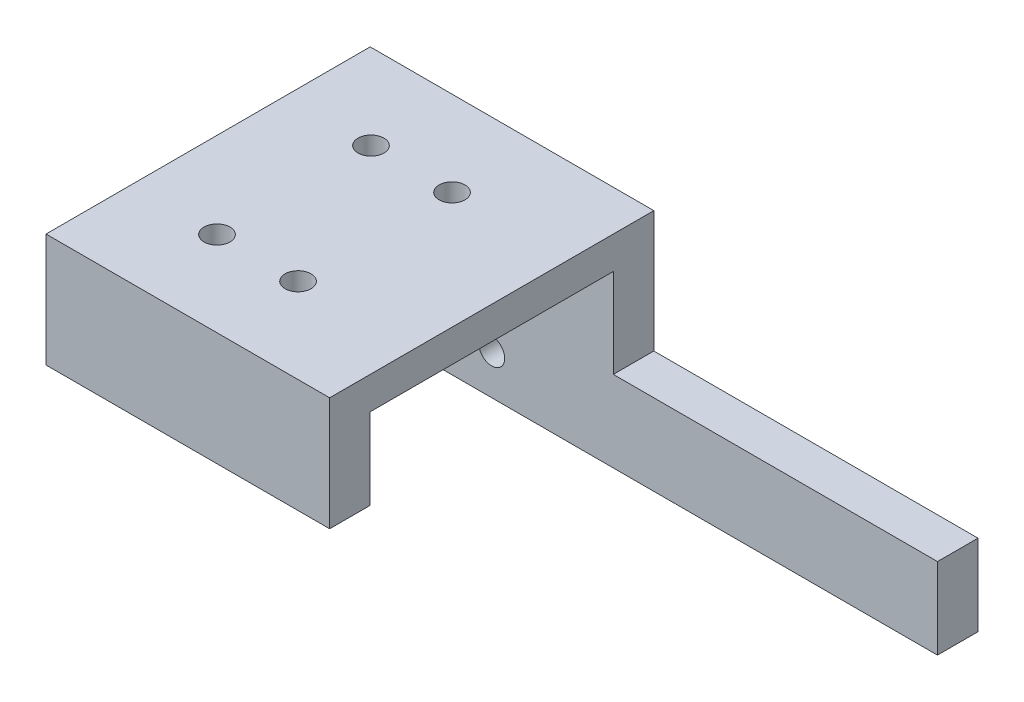
ISO-10303-21;
HEADER;
FILE_DESCRIPTION(('STEP AP214'),'2;1');
FILE_NAME('part.step','',(''),(''),'','','');
FILE_SCHEMA(('AUTOMOTIVE_DESIGN { 1 0 10303 214 1 1 1 1 }'));
ENDSEC;
DATA;
#1=APPLICATION_CONTEXT('core data for automotive mechanical design processes');
#2=APPLICATION_PROTOCOL_DEFINITION('international standard','automotive_design',2000,#1);
#3=PRODUCT_CONTEXT('',#1,'mechanical');
#4=PRODUCT('Part','Part','',(#3));
#5=PRODUCT_RELATED_PRODUCT_CATEGORY('part','',(#4));
#6=PRODUCT_DEFINITION_FORMATION('','',#4);
#7=PRODUCT_DEFINITION_CONTEXT('part definition',#1,'design');
#8=PRODUCT_DEFINITION('design','',#6,#7);
#9=PRODUCT_DEFINITION_SHAPE('','',#8);
#10=(LENGTH_UNIT() NAMED_UNIT(*) SI_UNIT(.MILLI.,.METRE.));
#11=(NAMED_UNIT(*) PLANE_ANGLE_UNIT() SI_UNIT($,.RADIAN.));
#12=(NAMED_UNIT(*) SI_UNIT($,.STERADIAN.) SOLID_ANGLE_UNIT());
#13=UNCERTAINTY_MEASURE_WITH_UNIT(LENGTH_MEASURE(1.E-05),#10,'distance_accuracy_value','');
#14=(GEOMETRIC_REPRESENTATION_CONTEXT(3) GLOBAL_UNCERTAINTY_ASSIGNED_CONTEXT((#13)) GLOBAL_UNIT_ASSIGNED_CONTEXT((#10,
#11,#12)) REPRESENTATION_CONTEXT('',''));
#15=CARTESIAN_POINT('',(0.,0.,0.));
#16=DIRECTION('',(0.,0.,1.));
#17=DIRECTION('',(1.,0.,0.));
#18=AXIS2_PLACEMENT_3D('',#15,#16,#17);
#19=CARTESIAN_POINT('',(0.,0.,0.));
#20=DIRECTION('',(0.,-1.,0.));
#21=DIRECTION('',(0.,0.,-1.));
#22=AXIS2_PLACEMENT_3D('',#19,#20,#21);
#23=PLANE('',#22);
#24=CARTESIAN_POINT('',(10.6,0.,-10.5));
#25=DIRECTION('',(0.,-1.,0.));
#26=DIRECTION('',(0.,0.,-1.));
#27=AXIS2_PLACEMENT_3D('',#24,#25,#26);
#28=CIRCLE('',#27,1.6);
#29=CARTESIAN_POINT('',(10.6,0.,-12.1));
#30=VERTEX_POINT('',#29);
#31=EDGE_CURVE('E214',#30,#30,#28,.T.);
#32=ORIENTED_EDGE('',*,*,#31,.F.);
#33=EDGE_LOOP('',(#32));
#34=FACE_BOUND('',#33,.T.);
#35=CARTESIAN_POINT('',(20.6,0.,-10.5));
#36=DIRECTION('',(0.,-1.,0.));
#37=DIRECTION('',(0.,0.,-1.));
#38=AXIS2_PLACEMENT_3D('',#35,#36,#37);
#39=CIRCLE('',#38,1.6);
#40=CARTESIAN_POINT('',(20.6,0.,-12.1));
#41=VERTEX_POINT('',#40);
#42=EDGE_CURVE('E226',#41,#41,#39,.T.);
#43=ORIENTED_EDGE('',*,*,#42,.F.);
#44=EDGE_LOOP('',(#43));
#45=FACE_BOUND('',#44,.T.);
#46=CARTESIAN_POINT('',(20.6,0.,-29.5));
#47=DIRECTION('',(0.,-1.,0.));
#48=DIRECTION('',(0.,0.,-1.));
#49=AXIS2_PLACEMENT_3D('',#46,#47,#48);
#50=CIRCLE('',#49,1.6);
#51=CARTESIAN_POINT('',(20.6,0.,-31.1));
#52=VERTEX_POINT('',#51);
#53=EDGE_CURVE('E223',#52,#52,#50,.T.);
#54=ORIENTED_EDGE('',*,*,#53,.F.);
#55=EDGE_LOOP('',(#54));
#56=FACE_BOUND('',#55,.T.);
#57=CARTESIAN_POINT('',(10.6,0.,-29.5));
#58=DIRECTION('',(0.,-1.,0.));
#59=DIRECTION('',(0.,0.,-1.));
#60=AXIS2_PLACEMENT_3D('',#57,#58,#59);
#61=CIRCLE('',#60,1.6);
#62=CARTESIAN_POINT('',(10.6,0.,-31.1));
#63=VERTEX_POINT('',#62);
#64=EDGE_CURVE('E202',#63,#63,#61,.T.);
#65=ORIENTED_EDGE('',*,*,#64,.F.);
#66=EDGE_LOOP('',(#65));
#67=FACE_BOUND('',#66,.T.);
#68=DIRECTION('',(0.,0.,-1.));
#69=VECTOR('',#68,1.);
#70=CARTESIAN_POINT('',(35.,0.,0.));
#71=LINE('',#70,#69);
#72=CARTESIAN_POINT('',(35.,0.,-5.));
#73=VERTEX_POINT('',#72);
#74=CARTESIAN_POINT('',(35.,0.,-35.));
#75=VERTEX_POINT('',#74);
#76=EDGE_CURVE('E62',#73,#75,#71,.T.);
#77=ORIENTED_EDGE('',*,*,#76,.F.);
#78=DIRECTION('',(1.,0.,0.));
#79=VECTOR('',#78,1.);
#80=CARTESIAN_POINT('',(0.,0.,-5.));
#81=LINE('',#80,#79);
#82=CARTESIAN_POINT('',(0.,0.,-5.));
#83=VERTEX_POINT('',#82);
#84=EDGE_CURVE('E136',#83,#73,#81,.T.);
#85=ORIENTED_EDGE('',*,*,#84,.F.);
#86=DIRECTION('',(0.,0.,1.));
#87=VECTOR('',#86,1.);
#88=CARTESIAN_POINT('',(0.,0.,0.));
#89=LINE('',#88,#87);
#90=CARTESIAN_POINT('',(0.,0.,-35.));
#91=VERTEX_POINT('',#90);
#92=EDGE_CURVE('E140',#91,#83,#89,.T.);
#93=ORIENTED_EDGE('',*,*,#92,.F.);
#94=DIRECTION('',(-1.,0.,0.));
#95=VECTOR('',#94,1.);
#96=CARTESIAN_POINT('',(0.,0.,-35.));
#97=LINE('',#96,#95);
#98=EDGE_CURVE('E179',#75,#91,#97,.T.);
#99=ORIENTED_EDGE('',*,*,#98,.F.);
#100=EDGE_LOOP('',(#77,#85,#93,#99));
#101=FACE_BOUND('',#100,.T.);
#102=ADVANCED_FACE('F37',(#34,#45,#56,#67,#101),#23,.T.);
#103=CARTESIAN_POINT('',(20.,-16.,-25.));
#104=DIRECTION('',(0.,0.,-1.));
#105=DIRECTION('',(-1.,0.,0.));
#106=AXIS2_PLACEMENT_3D('',#103,#104,#105);
#107=CYLINDRICAL_SURFACE('',#106,1.6);
#108=CARTESIAN_POINT('',(20.,-16.,-35.));
#109=DIRECTION('',(0.,0.,-1.));
#110=DIRECTION('',(-1.,0.,0.));
#111=AXIS2_PLACEMENT_3D('',#108,#109,#110);
#112=CIRCLE('',#111,1.6);
#113=CARTESIAN_POINT('',(18.4,-16.,-35.));
#114=VERTEX_POINT('',#113);
#115=EDGE_CURVE('E231',#114,#114,#112,.T.);
#116=ORIENTED_EDGE('',*,*,#115,.F.);
#117=EDGE_LOOP('',(#116));
#118=FACE_BOUND('',#117,.T.);
#119=CARTESIAN_POINT('',(20.,-16.,-38.));
#120=DIRECTION('',(0.,0.,-1.));
#121=DIRECTION('',(-1.,0.,0.));
#122=AXIS2_PLACEMENT_3D('',#119,#120,#121);
#123=CIRCLE('',#122,1.6);
#124=CARTESIAN_POINT('',(18.4,-16.,-38.));
#125=VERTEX_POINT('',#124);
#126=EDGE_CURVE('E41',#125,#125,#123,.F.);
#127=ORIENTED_EDGE('',*,*,#126,.F.);
#128=EDGE_LOOP('',(#127));
#129=FACE_BOUND('',#128,.T.);
#130=ADVANCED_FACE('F243',(#118,#129),#107,.F.);
#131=CARTESIAN_POINT('',(10.,-16.,-25.));
#132=DIRECTION('',(0.,0.,-1.));
#133=DIRECTION('',(-1.,0.,0.));
#134=AXIS2_PLACEMENT_3D('',#131,#132,#133);
#135=CYLINDRICAL_SURFACE('',#134,1.6);
#136=CARTESIAN_POINT('',(10.,-16.,-35.));
#137=DIRECTION('',(0.,0.,-1.));
#138=DIRECTION('',(-1.,0.,0.));
#139=AXIS2_PLACEMENT_3D('',#136,#137,#138);
#140=CIRCLE('',#139,1.6);
#141=CARTESIAN_POINT('',(8.4,-16.,-35.));
#142=VERTEX_POINT('',#141);
#143=EDGE_CURVE('E186',#142,#142,#140,.T.);
#144=ORIENTED_EDGE('',*,*,#143,.F.);
#145=EDGE_LOOP('',(#144));
#146=FACE_BOUND('',#145,.T.);
#147=CARTESIAN_POINT('',(10.,-16.,-38.));
#148=DIRECTION('',(0.,0.,-1.));
#149=DIRECTION('',(-1.,0.,0.));
#150=AXIS2_PLACEMENT_3D('',#147,#148,#149);
#151=CIRCLE('',#150,1.6);
#152=CARTESIAN_POINT('',(8.4,-16.,-38.));
#153=VERTEX_POINT('',#152);
#154=EDGE_CURVE('E166',#153,#153,#151,.F.);
#155=ORIENTED_EDGE('',*,*,#154,.F.);
#156=EDGE_LOOP('',(#155));
#157=FACE_BOUND('',#156,.T.);
#158=ADVANCED_FACE('F245',(#146,#157),#135,.F.);
#159=CARTESIAN_POINT('',(0.,4.,0.));
#160=DIRECTION('',(1.,0.,0.));
#161=DIRECTION('',(0.,0.,-1.));
#162=AXIS2_PLACEMENT_3D('',#159,#160,#161);
#163=PLANE('',#162);
#164=DIRECTION('',(0.,-1.,0.));
#165=VECTOR('',#164,1.);
#166=CARTESIAN_POINT('',(0.,4.,-40.));
#167=LINE('',#166,#165);
#168=CARTESIAN_POINT('',(0.,4.,-40.));
#169=VERTEX_POINT('',#168);
#170=CARTESIAN_POINT('',(0.,-21.,-40.));
#171=VERTEX_POINT('',#170);
#172=EDGE_CURVE('E212',#169,#171,#167,.T.);
#173=ORIENTED_EDGE('',*,*,#172,.T.);
#174=DIRECTION('',(0.,0.,-1.));
#175=VECTOR('',#174,1.);
#176=CARTESIAN_POINT('',(0.,-21.,-40.));
#177=LINE('',#176,#175);
#178=CARTESIAN_POINT('',(0.,-21.,-35.));
#179=VERTEX_POINT('',#178);
#180=EDGE_CURVE('E175',#179,#171,#177,.T.);
#181=ORIENTED_EDGE('',*,*,#180,.F.);
#182=DIRECTION('',(0.,1.,0.));
#183=VECTOR('',#182,1.);
#184=CARTESIAN_POINT('',(0.,-21.,-35.));
#185=LINE('',#184,#183);
#186=EDGE_CURVE('E183',#179,#91,#185,.T.);
#187=ORIENTED_EDGE('',*,*,#186,.T.);
#188=ORIENTED_EDGE('',*,*,#92,.T.);
#189=DIRECTION('',(0.,1.,0.));
#190=VECTOR('',#189,1.);
#191=CARTESIAN_POINT('',(0.,-10.,-5.));
#192=LINE('',#191,#190);
#193=CARTESIAN_POINT('',(0.,-10.,-5.));
#194=VERTEX_POINT('',#193);
#195=EDGE_CURVE('E120',#194,#83,#192,.T.);
#196=ORIENTED_EDGE('',*,*,#195,.F.);
#197=DIRECTION('',(0.,0.,-1.));
#198=VECTOR('',#197,1.);
#199=CARTESIAN_POINT('',(0.,-10.,0.));
#200=LINE('',#199,#198);
#201=CARTESIAN_POINT('',(0.,-10.,0.));
#202=VERTEX_POINT('',#201);
#203=EDGE_CURVE('E127',#202,#194,#200,.T.);
#204=ORIENTED_EDGE('',*,*,#203,.F.);
#205=DIRECTION('',(0.,-1.,0.));
#206=VECTOR('',#205,1.);
#207=CARTESIAN_POINT('',(0.,4.,0.));
#208=LINE('',#207,#206);
#209=CARTESIAN_POINT('',(0.,4.,0.));
#210=VERTEX_POINT('',#209);
#211=EDGE_CURVE('E11',#210,#202,#208,.T.);
#212=ORIENTED_EDGE('',*,*,#211,.F.);
#213=DIRECTION('',(0.,0.,1.));
#214=VECTOR('',#213,1.);
#215=CARTESIAN_POINT('',(0.,4.,0.));
#216=LINE('',#215,#214);
#217=EDGE_CURVE('E203',#169,#210,#216,.T.);
#218=ORIENTED_EDGE('',*,*,#217,.F.);
#219=EDGE_LOOP('',(#173,#181,#187,#188,#196,#204,#212,#218));
#220=FACE_BOUND('',#219,.T.);
#221=ADVANCED_FACE('F39',(#220),#163,.F.);
#222=CARTESIAN_POINT('',(0.,4.,0.));
#223=DIRECTION('',(0.,0.,-1.));
#224=DIRECTION('',(-1.,0.,0.));
#225=AXIS2_PLACEMENT_3D('',#222,#223,#224);
#226=PLANE('',#225);
#227=ORIENTED_EDGE('',*,*,#211,.T.);
#228=DIRECTION('',(-1.,0.,0.));
#229=VECTOR('',#228,1.);
#230=CARTESIAN_POINT('',(0.,-10.,0.));
#231=LINE('',#230,#229);
#232=CARTESIAN_POINT('',(35.,-10.,0.));
#233=VERTEX_POINT('',#232);
#234=EDGE_CURVE('E133',#233,#202,#231,.T.);
#235=ORIENTED_EDGE('',*,*,#234,.F.);
#236=DIRECTION('',(0.,-1.,0.));
#237=VECTOR('',#236,1.);
#238=CARTESIAN_POINT('',(35.,4.,0.));
#239=LINE('',#238,#237);
#240=CARTESIAN_POINT('',(35.,4.,0.));
#241=VERTEX_POINT('',#240);
#242=EDGE_CURVE('E46',#241,#233,#239,.T.);
#243=ORIENTED_EDGE('',*,*,#242,.F.);
#244=DIRECTION('',(1.,0.,0.));
#245=VECTOR('',#244,1.);
#246=CARTESIAN_POINT('',(0.,4.,0.));
#247=LINE('',#246,#245);
#248=EDGE_CURVE('E206',#210,#241,#247,.T.);
#249=ORIENTED_EDGE('',*,*,#248,.F.);
#250=EDGE_LOOP('',(#227,#235,#243,#249));
#251=FACE_BOUND('',#250,.T.);
#252=ADVANCED_FACE('F294',(#251),#226,.F.);
#253=CARTESIAN_POINT('',(35.,4.,0.));
#254=DIRECTION('',(-1.,0.,0.));
#255=DIRECTION('',(0.,0.,1.));
#256=AXIS2_PLACEMENT_3D('',#253,#254,#255);
#257=PLANE('',#256);
#258=DIRECTION('',(0.,1.,0.));
#259=VECTOR('',#258,1.);
#260=CARTESIAN_POINT('',(35.,-21.,-35.));
#261=LINE('',#260,#259);
#262=CARTESIAN_POINT('',(35.,-11.,-35.));
#263=VERTEX_POINT('',#262);
#264=EDGE_CURVE('E188',#263,#75,#261,.T.);
#265=ORIENTED_EDGE('',*,*,#264,.F.);
#266=DIRECTION('',(0.,0.,-1.));
#267=VECTOR('',#266,1.);
#268=CARTESIAN_POINT('',(35.,-11.,-35.));
#269=LINE('',#268,#267);
#270=CARTESIAN_POINT('',(35.,-11.,-40.));
#271=VERTEX_POINT('',#270);
#272=EDGE_CURVE('E152',#263,#271,#269,.T.);
#273=ORIENTED_EDGE('',*,*,#272,.T.);
#274=DIRECTION('',(0.,-1.,0.));
#275=VECTOR('',#274,1.);
#276=CARTESIAN_POINT('',(35.,4.,-40.));
#277=LINE('',#276,#275);
#278=CARTESIAN_POINT('',(35.,4.,-40.));
#279=VERTEX_POINT('',#278);
#280=EDGE_CURVE('E217',#279,#271,#277,.T.);
#281=ORIENTED_EDGE('',*,*,#280,.F.);
#282=DIRECTION('',(0.,0.,-1.));
#283=VECTOR('',#282,1.);
#284=CARTESIAN_POINT('',(35.,4.,0.));
#285=LINE('',#284,#283);
#286=EDGE_CURVE('E208',#241,#279,#285,.T.);
#287=ORIENTED_EDGE('',*,*,#286,.F.);
#288=ORIENTED_EDGE('',*,*,#242,.T.);
#289=DIRECTION('',(0.,0.,1.));
#290=VECTOR('',#289,1.);
#291=CARTESIAN_POINT('',(35.,-10.,0.));
#292=LINE('',#291,#290);
#293=CARTESIAN_POINT('',(35.,-10.,-5.));
#294=VERTEX_POINT('',#293);
#295=EDGE_CURVE('E126',#294,#233,#292,.T.);
#296=ORIENTED_EDGE('',*,*,#295,.F.);
#297=DIRECTION('',(0.,1.,0.));
#298=VECTOR('',#297,1.);
#299=CARTESIAN_POINT('',(35.,-10.,-5.));
#300=LINE('',#299,#298);
#301=EDGE_CURVE('E122',#294,#73,#300,.T.);
#302=ORIENTED_EDGE('',*,*,#301,.T.);
#303=ORIENTED_EDGE('',*,*,#76,.T.);
#304=EDGE_LOOP('',(#265,#273,#281,#287,#288,#296,#302,#303));
#305=FACE_BOUND('',#304,.T.);
#306=ADVANCED_FACE('F291',(#305),#257,.F.);
#307=CARTESIAN_POINT('',(0.,4.,-40.));
#308=DIRECTION('',(0.,0.,1.));
#309=DIRECTION('',(1.,0.,0.));
#310=AXIS2_PLACEMENT_3D('',#307,#308,#309);
#311=PLANE('',#310);
#312=CARTESIAN_POINT('',(20.,-16.,-40.));
#313=DIRECTION('',(0.,0.,-1.));
#314=DIRECTION('',(-1.,0.,0.));
#315=AXIS2_PLACEMENT_3D('',#312,#313,#314);
#316=CIRCLE('',#315,2.8);
#317=CARTESIAN_POINT('',(17.2,-16.,-40.));
#318=VERTEX_POINT('',#317);
#319=EDGE_CURVE('E167',#318,#318,#316,.T.);
#320=ORIENTED_EDGE('',*,*,#319,.F.);
#321=EDGE_LOOP('',(#320));
#322=FACE_BOUND('',#321,.T.);
#323=CARTESIAN_POINT('',(10.,-16.,-40.));
#324=DIRECTION('',(0.,0.,-1.));
#325=DIRECTION('',(-1.,0.,0.));
#326=AXIS2_PLACEMENT_3D('',#323,#324,#325);
#327=CIRCLE('',#326,2.8);
#328=CARTESIAN_POINT('',(7.2,-16.,-40.));
#329=VERTEX_POINT('',#328);
#330=EDGE_CURVE('E159',#329,#329,#327,.T.);
#331=ORIENTED_EDGE('',*,*,#330,.F.);
#332=EDGE_LOOP('',(#331));
#333=FACE_BOUND('',#332,.T.);
#334=ORIENTED_EDGE('',*,*,#280,.T.);
#335=DIRECTION('',(1.,0.,0.));
#336=VECTOR('',#335,1.);
#337=CARTESIAN_POINT('',(35.,-11.,-40.));
#338=LINE('',#337,#336);
#339=CARTESIAN_POINT('',(75.,-11.,-40.));
#340=VERTEX_POINT('',#339);
#341=EDGE_CURVE('E54',#271,#340,#338,.T.);
#342=ORIENTED_EDGE('',*,*,#341,.T.);
#343=DIRECTION('',(0.,-1.,0.));
#344=VECTOR('',#343,1.);
#345=CARTESIAN_POINT('',(75.,-21.,-40.));
#346=LINE('',#345,#344);
#347=CARTESIAN_POINT('',(75.,-21.,-40.));
#348=VERTEX_POINT('',#347);
#349=EDGE_CURVE('E142',#340,#348,#346,.T.);
#350=ORIENTED_EDGE('',*,*,#349,.T.);
#351=DIRECTION('',(1.,0.,0.));
#352=VECTOR('',#351,1.);
#353=CARTESIAN_POINT('',(0.,-21.,-40.));
#354=LINE('',#353,#352);
#355=EDGE_CURVE('E178',#171,#348,#354,.T.);
#356=ORIENTED_EDGE('',*,*,#355,.F.);
#357=ORIENTED_EDGE('',*,*,#172,.F.);
#358=DIRECTION('',(-1.,0.,0.));
#359=VECTOR('',#358,1.);
#360=CARTESIAN_POINT('',(0.,4.,-40.));
#361=LINE('',#360,#359);
#362=EDGE_CURVE('E210',#279,#169,#361,.T.);
#363=ORIENTED_EDGE('',*,*,#362,.F.);
#364=EDGE_LOOP('',(#334,#342,#350,#356,#357,#363));
#365=FACE_BOUND('',#364,.T.);
#366=ADVANCED_FACE('F286',(#322,#333,#365),#311,.F.);
#367=CARTESIAN_POINT('',(0.,4.,0.));
#368=DIRECTION('',(0.,-1.,0.));
#369=DIRECTION('',(0.,0.,-1.));
#370=AXIS2_PLACEMENT_3D('',#367,#368,#369);
#371=PLANE('',#370);
#372=CARTESIAN_POINT('',(10.6,4.,-10.5));
#373=DIRECTION('',(0.,1.,0.));
#374=DIRECTION('',(0.,0.,-1.));
#375=AXIS2_PLACEMENT_3D('',#372,#373,#374);
#376=CIRCLE('',#375,1.6);
#377=CARTESIAN_POINT('',(10.6,4.,-12.1));
#378=VERTEX_POINT('',#377);
#379=EDGE_CURVE('E190',#378,#378,#376,.T.);
#380=ORIENTED_EDGE('',*,*,#379,.F.);
#381=EDGE_LOOP('',(#380));
#382=FACE_BOUND('',#381,.T.);
#383=CARTESIAN_POINT('',(20.6,4.,-10.5));
#384=DIRECTION('',(0.,1.,0.));
#385=DIRECTION('',(0.,0.,1.));
#386=AXIS2_PLACEMENT_3D('',#383,#384,#385);
#387=CIRCLE('',#386,1.6);
#388=CARTESIAN_POINT('',(20.6,4.,-8.9));
#389=VERTEX_POINT('',#388);
#390=EDGE_CURVE('E195',#389,#389,#387,.T.);
#391=ORIENTED_EDGE('',*,*,#390,.F.);
#392=EDGE_LOOP('',(#391));
#393=FACE_BOUND('',#392,.T.);
#394=CARTESIAN_POINT('',(20.6,4.,-29.5));
#395=DIRECTION('',(0.,1.,0.));
#396=DIRECTION('',(0.,0.,-1.));
#397=AXIS2_PLACEMENT_3D('',#394,#395,#396);
#398=CIRCLE('',#397,1.6);
#399=CARTESIAN_POINT('',(20.6,4.,-31.1));
#400=VERTEX_POINT('',#399);
#401=EDGE_CURVE('E191',#400,#400,#398,.T.);
#402=ORIENTED_EDGE('',*,*,#401,.F.);
#403=EDGE_LOOP('',(#402));
#404=FACE_BOUND('',#403,.T.);
#405=CARTESIAN_POINT('',(10.6,4.,-29.5));
#406=DIRECTION('',(0.,1.,0.));
#407=DIRECTION('',(0.,0.,1.));
#408=AXIS2_PLACEMENT_3D('',#405,#406,#407);
#409=CIRCLE('',#408,1.6);
#410=CARTESIAN_POINT('',(10.6,4.,-27.9));
#411=VERTEX_POINT('',#410);
#412=EDGE_CURVE('E194',#411,#411,#409,.T.);
#413=ORIENTED_EDGE('',*,*,#412,.F.);
#414=EDGE_LOOP('',(#413));
#415=FACE_BOUND('',#414,.T.);
#416=ORIENTED_EDGE('',*,*,#217,.T.);
#417=ORIENTED_EDGE('',*,*,#248,.T.);
#418=ORIENTED_EDGE('',*,*,#286,.T.);
#419=ORIENTED_EDGE('',*,*,#362,.T.);
#420=EDGE_LOOP('',(#416,#417,#418,#419));
#421=FACE_BOUND('',#420,.T.);
#422=ADVANCED_FACE('F283',(#382,#393,#404,#415,#421),#371,.F.);
#423=CARTESIAN_POINT('',(10.6,-2.,-29.5));
#424=DIRECTION('',(0.,1.,0.));
#425=DIRECTION('',(0.,0.,1.));
#426=AXIS2_PLACEMENT_3D('',#423,#424,#425);
#427=CYLINDRICAL_SURFACE('',#426,1.6);
#428=ORIENTED_EDGE('',*,*,#64,.T.);
#429=EDGE_LOOP('',(#428));
#430=FACE_BOUND('',#429,.T.);
#431=ORIENTED_EDGE('',*,*,#412,.T.);
#432=EDGE_LOOP('',(#431));
#433=FACE_BOUND('',#432,.T.);
#434=ADVANCED_FACE('F273',(#430,#433),#427,.F.);
#435=CARTESIAN_POINT('',(20.6,-2.,-29.5));
#436=DIRECTION('',(0.,1.,0.));
#437=DIRECTION('',(0.,0.,1.));
#438=AXIS2_PLACEMENT_3D('',#435,#436,#437);
#439=CYLINDRICAL_SURFACE('',#438,1.6);
#440=ORIENTED_EDGE('',*,*,#53,.T.);
#441=EDGE_LOOP('',(#440));
#442=FACE_BOUND('',#441,.T.);
#443=ORIENTED_EDGE('',*,*,#401,.T.);
#444=EDGE_LOOP('',(#443));
#445=FACE_BOUND('',#444,.T.);
#446=ADVANCED_FACE('F269',(#442,#445),#439,.F.);
#447=CARTESIAN_POINT('',(20.6,-2.,-10.5));
#448=DIRECTION('',(0.,1.,0.));
#449=DIRECTION('',(0.,0.,1.));
#450=AXIS2_PLACEMENT_3D('',#447,#448,#449);
#451=CYLINDRICAL_SURFACE('',#450,1.6);
#452=ORIENTED_EDGE('',*,*,#42,.T.);
#453=EDGE_LOOP('',(#452));
#454=FACE_BOUND('',#453,.T.);
#455=ORIENTED_EDGE('',*,*,#390,.T.);
#456=EDGE_LOOP('',(#455));
#457=FACE_BOUND('',#456,.T.);
#458=ADVANCED_FACE('F272',(#454,#457),#451,.F.);
#459=CARTESIAN_POINT('',(10.6,-2.,-10.5));
#460=DIRECTION('',(0.,1.,0.));
#461=DIRECTION('',(0.,0.,1.));
#462=AXIS2_PLACEMENT_3D('',#459,#460,#461);
#463=CYLINDRICAL_SURFACE('',#462,1.6);
#464=ORIENTED_EDGE('',*,*,#31,.T.);
#465=EDGE_LOOP('',(#464));
#466=FACE_BOUND('',#465,.T.);
#467=ORIENTED_EDGE('',*,*,#379,.T.);
#468=EDGE_LOOP('',(#467));
#469=FACE_BOUND('',#468,.T.);
#470=ADVANCED_FACE('F267',(#466,#469),#463,.F.);
#471=CARTESIAN_POINT('',(0.,-21.,-35.));
#472=DIRECTION('',(0.,0.,-1.));
#473=DIRECTION('',(-1.,0.,0.));
#474=AXIS2_PLACEMENT_3D('',#471,#472,#473);
#475=PLANE('',#474);
#476=ORIENTED_EDGE('',*,*,#143,.T.);
#477=EDGE_LOOP('',(#476));
#478=FACE_BOUND('',#477,.T.);
#479=ORIENTED_EDGE('',*,*,#115,.T.);
#480=EDGE_LOOP('',(#479));
#481=FACE_BOUND('',#480,.T.);
#482=ORIENTED_EDGE('',*,*,#98,.T.);
#483=ORIENTED_EDGE('',*,*,#186,.F.);
#484=DIRECTION('',(-1.,0.,0.));
#485=VECTOR('',#484,1.);
#486=CARTESIAN_POINT('',(0.,-21.,-35.));
#487=LINE('',#486,#485);
#488=CARTESIAN_POINT('',(75.,-21.,-35.));
#489=VERTEX_POINT('',#488);
#490=EDGE_CURVE('E181',#489,#179,#487,.T.);
#491=ORIENTED_EDGE('',*,*,#490,.F.);
#492=DIRECTION('',(0.,-1.,0.));
#493=VECTOR('',#492,1.);
#494=CARTESIAN_POINT('',(75.,-21.,-35.));
#495=LINE('',#494,#493);
#496=CARTESIAN_POINT('',(75.,-11.,-35.));
#497=VERTEX_POINT('',#496);
#498=EDGE_CURVE('E150',#497,#489,#495,.T.);
#499=ORIENTED_EDGE('',*,*,#498,.F.);
#500=DIRECTION('',(1.,0.,0.));
#501=VECTOR('',#500,1.);
#502=CARTESIAN_POINT('',(35.,-11.,-35.));
#503=LINE('',#502,#501);
#504=EDGE_CURVE('E147',#263,#497,#503,.T.);
#505=ORIENTED_EDGE('',*,*,#504,.F.);
#506=ORIENTED_EDGE('',*,*,#264,.T.);
#507=EDGE_LOOP('',(#482,#483,#491,#499,#505,#506));
#508=FACE_BOUND('',#507,.T.);
#509=ADVANCED_FACE('F263',(#478,#481,#508),#475,.F.);
#510=CARTESIAN_POINT('',(0.,-21.,0.));
#511=DIRECTION('',(0.,1.,0.));
#512=DIRECTION('',(0.,0.,1.));
#513=AXIS2_PLACEMENT_3D('',#510,#511,#512);
#514=PLANE('',#513);
#515=ORIENTED_EDGE('',*,*,#180,.T.);
#516=ORIENTED_EDGE('',*,*,#355,.T.);
#517=DIRECTION('',(0.,0.,-1.));
#518=VECTOR('',#517,1.);
#519=CARTESIAN_POINT('',(75.,-21.,-35.));
#520=LINE('',#519,#518);
#521=EDGE_CURVE('E156',#489,#348,#520,.T.);
#522=ORIENTED_EDGE('',*,*,#521,.F.);
#523=ORIENTED_EDGE('',*,*,#490,.T.);
#524=EDGE_LOOP('',(#515,#516,#522,#523));
#525=FACE_BOUND('',#524,.T.);
#526=ADVANCED_FACE('F259',(#525),#514,.F.);
#527=CARTESIAN_POINT('',(10.,-16.,-38.));
#528=DIRECTION('',(0.,0.,-1.));
#529=DIRECTION('',(-1.,0.,0.));
#530=AXIS2_PLACEMENT_3D('',#527,#528,#529);
#531=PLANE('',#530);
#532=CARTESIAN_POINT('',(10.,-16.,-38.));
#533=DIRECTION('',(0.,0.,-1.));
#534=DIRECTION('',(-1.,0.,0.));
#535=AXIS2_PLACEMENT_3D('',#532,#533,#534);
#536=CIRCLE('',#535,2.8);
#537=CARTESIAN_POINT('',(7.2,-16.,-38.));
#538=VERTEX_POINT('',#537);
#539=EDGE_CURVE('E170',#538,#538,#536,.T.);
#540=ORIENTED_EDGE('',*,*,#539,.T.);
#541=EDGE_LOOP('',(#540));
#542=FACE_BOUND('',#541,.T.);
#543=ORIENTED_EDGE('',*,*,#154,.T.);
#544=EDGE_LOOP('',(#543));
#545=FACE_BOUND('',#544,.T.);
#546=ADVANCED_FACE('F262',(#542,#545),#531,.T.);
#547=CARTESIAN_POINT('',(10.,-16.,-38.));
#548=DIRECTION('',(0.,0.,-1.));
#549=DIRECTION('',(-1.,0.,0.));
#550=AXIS2_PLACEMENT_3D('',#547,#548,#549);
#551=CYLINDRICAL_SURFACE('',#550,2.8);
#552=ORIENTED_EDGE('',*,*,#539,.F.);
#553=EDGE_LOOP('',(#552));
#554=FACE_BOUND('',#553,.T.);
#555=ORIENTED_EDGE('',*,*,#330,.T.);
#556=EDGE_LOOP('',(#555));
#557=FACE_BOUND('',#556,.T.);
#558=ADVANCED_FACE('F337',(#554,#557),#551,.F.);
#559=CARTESIAN_POINT('',(20.,-16.,-38.));
#560=DIRECTION('',(0.,0.,-1.));
#561=DIRECTION('',(-1.,0.,0.));
#562=AXIS2_PLACEMENT_3D('',#559,#560,#561);
#563=PLANE('',#562);
#564=CARTESIAN_POINT('',(20.,-16.,-38.));
#565=DIRECTION('',(0.,0.,-1.));
#566=DIRECTION('',(-1.,0.,0.));
#567=AXIS2_PLACEMENT_3D('',#564,#565,#566);
#568=CIRCLE('',#567,2.8);
#569=CARTESIAN_POINT('',(17.2,-16.,-38.));
#570=VERTEX_POINT('',#569);
#571=EDGE_CURVE('E163',#570,#570,#568,.T.);
#572=ORIENTED_EDGE('',*,*,#571,.T.);
#573=EDGE_LOOP('',(#572));
#574=FACE_BOUND('',#573,.T.);
#575=ORIENTED_EDGE('',*,*,#126,.T.);
#576=EDGE_LOOP('',(#575));
#577=FACE_BOUND('',#576,.T.);
#578=ADVANCED_FACE('F241',(#574,#577),#563,.T.);
#579=CARTESIAN_POINT('',(20.,-16.,-38.));
#580=DIRECTION('',(0.,0.,-1.));
#581=DIRECTION('',(-1.,0.,0.));
#582=AXIS2_PLACEMENT_3D('',#579,#580,#581);
#583=CYLINDRICAL_SURFACE('',#582,2.8);
#584=ORIENTED_EDGE('',*,*,#571,.F.);
#585=EDGE_LOOP('',(#584));
#586=FACE_BOUND('',#585,.T.);
#587=ORIENTED_EDGE('',*,*,#319,.T.);
#588=EDGE_LOOP('',(#587));
#589=FACE_BOUND('',#588,.T.);
#590=ADVANCED_FACE('F324',(#586,#589),#583,.F.);
#591=CARTESIAN_POINT('',(75.,-21.,-35.));
#592=DIRECTION('',(1.,0.,0.));
#593=DIRECTION('',(0.,0.,-1.));
#594=AXIS2_PLACEMENT_3D('',#591,#592,#593);
#595=PLANE('',#594);
#596=ORIENTED_EDGE('',*,*,#349,.F.);
#597=DIRECTION('',(0.,0.,-1.));
#598=VECTOR('',#597,1.);
#599=CARTESIAN_POINT('',(75.,-11.,-35.));
#600=LINE('',#599,#598);
#601=EDGE_CURVE('E160',#497,#340,#600,.T.);
#602=ORIENTED_EDGE('',*,*,#601,.F.);
#603=ORIENTED_EDGE('',*,*,#498,.T.);
#604=ORIENTED_EDGE('',*,*,#521,.T.);
#605=EDGE_LOOP('',(#596,#602,#603,#604));
#606=FACE_BOUND('',#605,.T.);
#607=ADVANCED_FACE('F322',(#606),#595,.T.);
#608=CARTESIAN_POINT('',(35.,-11.,-35.));
#609=DIRECTION('',(0.,1.,0.));
#610=DIRECTION('',(-1.,0.,0.));
#611=AXIS2_PLACEMENT_3D('',#608,#609,#610);
#612=PLANE('',#611);
#613=ORIENTED_EDGE('',*,*,#341,.F.);
#614=ORIENTED_EDGE('',*,*,#272,.F.);
#615=ORIENTED_EDGE('',*,*,#504,.T.);
#616=ORIENTED_EDGE('',*,*,#601,.T.);
#617=EDGE_LOOP('',(#613,#614,#615,#616));
#618=FACE_BOUND('',#617,.T.);
#619=ADVANCED_FACE('F320',(#618),#612,.T.);
#620=CARTESIAN_POINT('',(0.,-10.,-5.));
#621=DIRECTION('',(0.,0.,1.));
#622=DIRECTION('',(1.,0.,0.));
#623=AXIS2_PLACEMENT_3D('',#620,#621,#622);
#624=PLANE('',#623);
#625=ORIENTED_EDGE('',*,*,#84,.T.);
#626=ORIENTED_EDGE('',*,*,#301,.F.);
#627=DIRECTION('',(1.,0.,0.));
#628=VECTOR('',#627,1.);
#629=CARTESIAN_POINT('',(0.,-10.,-5.));
#630=LINE('',#629,#628);
#631=EDGE_CURVE('E116',#194,#294,#630,.T.);
#632=ORIENTED_EDGE('',*,*,#631,.F.);
#633=ORIENTED_EDGE('',*,*,#195,.T.);
#634=EDGE_LOOP('',(#625,#626,#632,#633));
#635=FACE_BOUND('',#634,.T.);
#636=ADVANCED_FACE('F118',(#635),#624,.F.);
#637=CARTESIAN_POINT('',(0.,-10.,0.));
#638=DIRECTION('',(0.,-1.,0.));
#639=DIRECTION('',(0.,0.,-1.));
#640=AXIS2_PLACEMENT_3D('',#637,#638,#639);
#641=PLANE('',#640);
#642=ORIENTED_EDGE('',*,*,#203,.T.);
#643=ORIENTED_EDGE('',*,*,#631,.T.);
#644=ORIENTED_EDGE('',*,*,#295,.T.);
#645=ORIENTED_EDGE('',*,*,#234,.T.);
#646=EDGE_LOOP('',(#642,#643,#644,#645));
#647=FACE_BOUND('',#646,.T.);
#648=ADVANCED_FACE('F131',(#647),#641,.T.);
#649=CLOSED_SHELL('',(#102,#130,#158,#221,#252,#306,#366,#422,#434,#446,#458,#470,#509,#526,
#546,#558,#578,#590,#607,#619,#636,#648));
#650=MANIFOLD_SOLID_BREP('B2',#649);
#651=ADVANCED_BREP_SHAPE_REPRESENTATION('',(#18,#650),#14);
#652=SHAPE_DEFINITION_REPRESENTATION(#9,#651);
ENDSEC;
END-ISO-10303-21;
